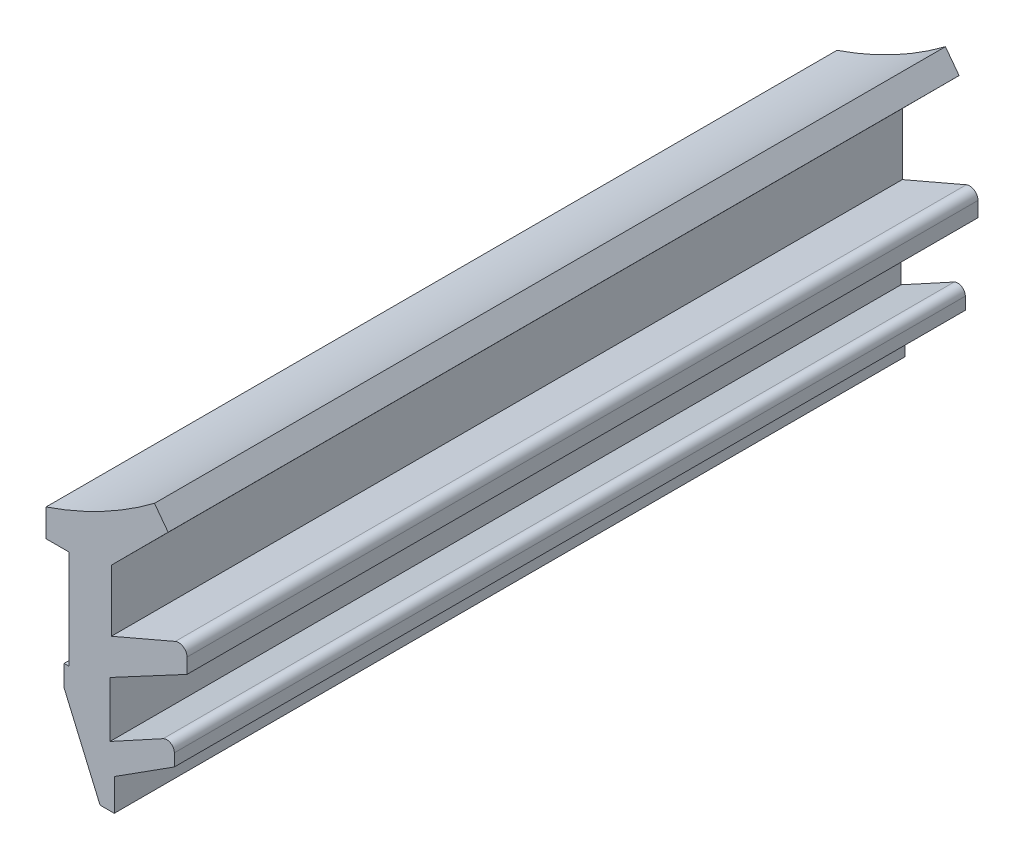
ISO-10303-21;
HEADER;
FILE_DESCRIPTION(('STEP AP214'),'2;1');
FILE_NAME('part.step','',(''),(''),'','','');
FILE_SCHEMA(('AUTOMOTIVE_DESIGN { 1 0 10303 214 1 1 1 1 }'));
ENDSEC;
DATA;
#1=APPLICATION_CONTEXT('core data for automotive mechanical design processes');
#2=APPLICATION_PROTOCOL_DEFINITION('international standard','automotive_design',2000,#1);
#3=PRODUCT_CONTEXT('',#1,'mechanical');
#4=PRODUCT('Part','Part','',(#3));
#5=PRODUCT_RELATED_PRODUCT_CATEGORY('part','',(#4));
#6=PRODUCT_DEFINITION_FORMATION('','',#4);
#7=PRODUCT_DEFINITION_CONTEXT('part definition',#1,'design');
#8=PRODUCT_DEFINITION('design','',#6,#7);
#9=PRODUCT_DEFINITION_SHAPE('','',#8);
#10=(LENGTH_UNIT() NAMED_UNIT(*) SI_UNIT(.MILLI.,.METRE.));
#11=(NAMED_UNIT(*) PLANE_ANGLE_UNIT() SI_UNIT($,.RADIAN.));
#12=(NAMED_UNIT(*) SI_UNIT($,.STERADIAN.) SOLID_ANGLE_UNIT());
#13=UNCERTAINTY_MEASURE_WITH_UNIT(LENGTH_MEASURE(1.E-05),#10,'distance_accuracy_value','');
#14=(GEOMETRIC_REPRESENTATION_CONTEXT(3) GLOBAL_UNCERTAINTY_ASSIGNED_CONTEXT((#13)) GLOBAL_UNIT_ASSIGNED_CONTEXT((#10,
#11,#12)) REPRESENTATION_CONTEXT('',''));
#15=CARTESIAN_POINT('',(0.,0.,0.));
#16=DIRECTION('',(0.,0.,1.));
#17=DIRECTION('',(1.,0.,0.));
#18=AXIS2_PLACEMENT_3D('',#15,#16,#17);
#19=CARTESIAN_POINT('',(0.,0.,40.));
#20=DIRECTION('',(0.,1.,0.));
#21=DIRECTION('',(0.,0.,1.));
#22=AXIS2_PLACEMENT_3D('',#19,#20,#21);
#23=PLANE('',#22);
#24=DIRECTION('',(1.,0.,0.));
#25=VECTOR('',#24,1.);
#26=CARTESIAN_POINT('',(0.,0.,0.));
#27=LINE('',#26,#25);
#28=CARTESIAN_POINT('',(-1.15231783764838,0.,0.));
#29=VERTEX_POINT('',#28);
#30=CARTESIAN_POINT('',(0.,0.,0.));
#31=VERTEX_POINT('',#30);
#32=EDGE_CURVE('E206',#29,#31,#27,.T.);
#33=ORIENTED_EDGE('',*,*,#32,.T.);
#34=DIRECTION('',(0.,0.,-1.));
#35=VECTOR('',#34,1.);
#36=CARTESIAN_POINT('',(0.,0.,40.));
#37=LINE('',#36,#35);
#38=CARTESIAN_POINT('',(0.,0.,40.));
#39=VERTEX_POINT('',#38);
#40=EDGE_CURVE('E11',#39,#31,#37,.T.);
#41=ORIENTED_EDGE('',*,*,#40,.F.);
#42=DIRECTION('',(1.,0.,0.));
#43=VECTOR('',#42,1.);
#44=CARTESIAN_POINT('',(0.,0.,40.));
#45=LINE('',#44,#43);
#46=CARTESIAN_POINT('',(-1.15231783764838,0.,40.));
#47=VERTEX_POINT('',#46);
#48=EDGE_CURVE('E246',#47,#39,#45,.T.);
#49=ORIENTED_EDGE('',*,*,#48,.F.);
#50=DIRECTION('',(0.,0.,-1.));
#51=VECTOR('',#50,1.);
#52=CARTESIAN_POINT('',(-1.15231783764838,0.,40.));
#53=LINE('',#52,#51);
#54=EDGE_CURVE('E202',#47,#29,#53,.T.);
#55=ORIENTED_EDGE('',*,*,#54,.T.);
#56=EDGE_LOOP('',(#33,#41,#49,#55));
#57=FACE_BOUND('',#56,.T.);
#58=ADVANCED_FACE('F32',(#57),#23,.F.);
#59=CARTESIAN_POINT('',(0.,0.,40.));
#60=DIRECTION('',(1.,0.,0.));
#61=DIRECTION('',(0.,1.,0.));
#62=AXIS2_PLACEMENT_3D('',#59,#60,#61);
#63=PLANE('',#62);
#64=DIRECTION('',(0.,-1.,0.));
#65=VECTOR('',#64,1.);
#66=CARTESIAN_POINT('',(0.,0.,0.));
#67=LINE('',#66,#65);
#68=CARTESIAN_POINT('',(0.,-5.,0.));
#69=VERTEX_POINT('',#68);
#70=EDGE_CURVE('E209',#31,#69,#67,.T.);
#71=ORIENTED_EDGE('',*,*,#70,.T.);
#72=DIRECTION('',(0.,0.,-1.));
#73=VECTOR('',#72,1.);
#74=CARTESIAN_POINT('',(0.,-5.,40.));
#75=LINE('',#74,#73);
#76=CARTESIAN_POINT('',(0.,-5.,40.));
#77=VERTEX_POINT('',#76);
#78=EDGE_CURVE('E40',#77,#69,#75,.T.);
#79=ORIENTED_EDGE('',*,*,#78,.F.);
#80=DIRECTION('',(0.,-1.,0.));
#81=VECTOR('',#80,1.);
#82=CARTESIAN_POINT('',(0.,0.,40.));
#83=LINE('',#82,#81);
#84=EDGE_CURVE('E130',#39,#77,#83,.T.);
#85=ORIENTED_EDGE('',*,*,#84,.F.);
#86=ORIENTED_EDGE('',*,*,#40,.T.);
#87=EDGE_LOOP('',(#71,#79,#85,#86));
#88=FACE_BOUND('',#87,.T.);
#89=ADVANCED_FACE('F369',(#88),#63,.F.);
#90=CARTESIAN_POINT('',(-0.235052358890928,-5.,40.));
#91=DIRECTION('',(0.,-1.,0.));
#92=DIRECTION('',(0.,0.,-1.));
#93=AXIS2_PLACEMENT_3D('',#90,#91,#92);
#94=PLANE('',#93);
#95=DIRECTION('',(-1.,0.,0.));
#96=VECTOR('',#95,1.);
#97=CARTESIAN_POINT('',(-0.235052358890928,-5.,0.));
#98=LINE('',#97,#96);
#99=CARTESIAN_POINT('',(-0.235052358890928,-5.,0.));
#100=VERTEX_POINT('',#99);
#101=EDGE_CURVE('E211',#69,#100,#98,.T.);
#102=ORIENTED_EDGE('',*,*,#101,.T.);
#103=DIRECTION('',(0.,0.,-1.));
#104=VECTOR('',#103,1.);
#105=CARTESIAN_POINT('',(-0.235052358890928,-5.,40.));
#106=LINE('',#105,#104);
#107=CARTESIAN_POINT('',(-0.235052358890928,-5.,40.));
#108=VERTEX_POINT('',#107);
#109=EDGE_CURVE('E292',#108,#100,#106,.T.);
#110=ORIENTED_EDGE('',*,*,#109,.F.);
#111=DIRECTION('',(-1.,0.,0.));
#112=VECTOR('',#111,1.);
#113=CARTESIAN_POINT('',(-0.235052358890928,-5.,40.));
#114=LINE('',#113,#112);
#115=EDGE_CURVE('E300',#77,#108,#114,.T.);
#116=ORIENTED_EDGE('',*,*,#115,.F.);
#117=ORIENTED_EDGE('',*,*,#78,.T.);
#118=EDGE_LOOP('',(#102,#110,#116,#117));
#119=FACE_BOUND('',#118,.T.);
#120=ADVANCED_FACE('F298',(#119),#94,.F.);
#121=CARTESIAN_POINT('',(-0.235052358890928,-6.07753064526559,40.));
#122=DIRECTION('',(1.,0.,0.));
#123=DIRECTION('',(0.,0.,-1.));
#124=AXIS2_PLACEMENT_3D('',#121,#122,#123);
#125=PLANE('',#124);
#126=DIRECTION('',(0.,-1.,0.));
#127=VECTOR('',#126,1.);
#128=CARTESIAN_POINT('',(-0.235052358890928,-6.07753064526559,0.));
#129=LINE('',#128,#127);
#130=CARTESIAN_POINT('',(-0.235052358890928,-6.07753064526559,0.));
#131=VERTEX_POINT('',#130);
#132=EDGE_CURVE('E213',#100,#131,#129,.T.);
#133=ORIENTED_EDGE('',*,*,#132,.T.);
#134=DIRECTION('',(0.,0.,-1.));
#135=VECTOR('',#134,1.);
#136=CARTESIAN_POINT('',(-0.235052358890928,-6.07753064526559,40.));
#137=LINE('',#136,#135);
#138=CARTESIAN_POINT('',(-0.235052358890928,-6.07753064526559,40.));
#139=VERTEX_POINT('',#138);
#140=EDGE_CURVE('E289',#139,#131,#137,.T.);
#141=ORIENTED_EDGE('',*,*,#140,.F.);
#142=DIRECTION('',(0.,-1.,0.));
#143=VECTOR('',#142,1.);
#144=CARTESIAN_POINT('',(-0.235052358890928,-6.07753064526559,40.));
#145=LINE('',#144,#143);
#146=EDGE_CURVE('E318',#108,#139,#145,.T.);
#147=ORIENTED_EDGE('',*,*,#146,.F.);
#148=ORIENTED_EDGE('',*,*,#109,.T.);
#149=EDGE_LOOP('',(#133,#141,#147,#148));
#150=FACE_BOUND('',#149,.T.);
#151=ADVANCED_FACE('F309',(#150),#125,.F.);
#152=CARTESIAN_POINT('',(1.5808794778396,-10.3000267175351,40.));
#153=DIRECTION('',(0.918648775054495,0.395075218269732,0.));
#154=DIRECTION('',(-0.395075218269732,0.918648775054495,0.));
#155=AXIS2_PLACEMENT_3D('',#152,#153,#154);
#156=PLANE('',#155);
#157=DIRECTION('',(0.395075218269732,-0.918648775054495,0.));
#158=VECTOR('',#157,1.);
#159=CARTESIAN_POINT('',(1.5808794778396,-10.3000267175351,0.));
#160=LINE('',#159,#158);
#161=CARTESIAN_POINT('',(1.5808794778396,-10.3000267175351,0.));
#162=VERTEX_POINT('',#161);
#163=EDGE_CURVE('E215',#131,#162,#160,.T.);
#164=ORIENTED_EDGE('',*,*,#163,.T.);
#165=DIRECTION('',(0.,0.,-1.));
#166=VECTOR('',#165,1.);
#167=CARTESIAN_POINT('',(1.5808794778396,-10.3000267175351,40.));
#168=LINE('',#167,#166);
#169=CARTESIAN_POINT('',(1.5808794778396,-10.3000267175351,40.));
#170=VERTEX_POINT('',#169);
#171=EDGE_CURVE('E286',#170,#162,#168,.T.);
#172=ORIENTED_EDGE('',*,*,#171,.F.);
#173=DIRECTION('',(0.395075218269732,-0.918648775054495,0.));
#174=VECTOR('',#173,1.);
#175=CARTESIAN_POINT('',(1.5808794778396,-10.3000267175351,40.));
#176=LINE('',#175,#174);
#177=EDGE_CURVE('E315',#139,#170,#176,.T.);
#178=ORIENTED_EDGE('',*,*,#177,.F.);
#179=ORIENTED_EDGE('',*,*,#140,.T.);
#180=EDGE_LOOP('',(#164,#172,#178,#179));
#181=FACE_BOUND('',#180,.T.);
#182=ADVANCED_FACE('F313',(#181),#156,.F.);
#183=CARTESIAN_POINT('',(2.29987679427467,-10.3000267175351,40.));
#184=DIRECTION('',(0.,1.,0.));
#185=DIRECTION('',(0.,0.,1.));
#186=AXIS2_PLACEMENT_3D('',#183,#184,#185);
#187=PLANE('',#186);
#188=DIRECTION('',(1.,0.,0.));
#189=VECTOR('',#188,1.);
#190=CARTESIAN_POINT('',(2.29987679427467,-10.3000267175351,0.));
#191=LINE('',#190,#189);
#192=CARTESIAN_POINT('',(2.29987679427467,-10.3000267175351,0.));
#193=VERTEX_POINT('',#192);
#194=EDGE_CURVE('E217',#162,#193,#191,.T.);
#195=ORIENTED_EDGE('',*,*,#194,.T.);
#196=DIRECTION('',(0.,0.,-1.));
#197=VECTOR('',#196,1.);
#198=CARTESIAN_POINT('',(2.29987679427467,-10.3000267175351,40.));
#199=LINE('',#198,#197);
#200=CARTESIAN_POINT('',(2.29987679427467,-10.3000267175351,40.));
#201=VERTEX_POINT('',#200);
#202=EDGE_CURVE('E283',#201,#193,#199,.T.);
#203=ORIENTED_EDGE('',*,*,#202,.F.);
#204=DIRECTION('',(1.,0.,0.));
#205=VECTOR('',#204,1.);
#206=CARTESIAN_POINT('',(2.29987679427467,-10.3000267175351,40.));
#207=LINE('',#206,#205);
#208=EDGE_CURVE('E317',#170,#201,#207,.T.);
#209=ORIENTED_EDGE('',*,*,#208,.F.);
#210=ORIENTED_EDGE('',*,*,#171,.T.);
#211=EDGE_LOOP('',(#195,#203,#209,#210));
#212=FACE_BOUND('',#211,.T.);
#213=ADVANCED_FACE('F382',(#212),#187,.F.);
#214=CARTESIAN_POINT('',(2.29987679427468,-8.68824894517343,40.));
#215=DIRECTION('',(-1.,0.,0.));
#216=DIRECTION('',(0.,-1.,0.));
#217=AXIS2_PLACEMENT_3D('',#214,#215,#216);
#218=PLANE('',#217);
#219=DIRECTION('',(0.,1.,0.));
#220=VECTOR('',#219,1.);
#221=CARTESIAN_POINT('',(2.29987679427468,-8.68824894517343,0.));
#222=LINE('',#221,#220);
#223=CARTESIAN_POINT('',(2.29987679427468,-8.68824894517343,0.));
#224=VERTEX_POINT('',#223);
#225=EDGE_CURVE('E219',#193,#224,#222,.T.);
#226=ORIENTED_EDGE('',*,*,#225,.T.);
#227=DIRECTION('',(0.,0.,-1.));
#228=VECTOR('',#227,1.);
#229=CARTESIAN_POINT('',(2.29987679427468,-8.68824894517343,40.));
#230=LINE('',#229,#228);
#231=CARTESIAN_POINT('',(2.29987679427468,-8.68824894517343,40.));
#232=VERTEX_POINT('',#231);
#233=EDGE_CURVE('E280',#232,#224,#230,.T.);
#234=ORIENTED_EDGE('',*,*,#233,.F.);
#235=DIRECTION('',(0.,1.,0.));
#236=VECTOR('',#235,1.);
#237=CARTESIAN_POINT('',(2.29987679427468,-8.68824894517343,40.));
#238=LINE('',#237,#236);
#239=EDGE_CURVE('E320',#201,#232,#238,.T.);
#240=ORIENTED_EDGE('',*,*,#239,.F.);
#241=ORIENTED_EDGE('',*,*,#202,.T.);
#242=EDGE_LOOP('',(#226,#234,#240,#241));
#243=FACE_BOUND('',#242,.T.);
#244=ADVANCED_FACE('F385',(#243),#218,.F.);
#245=CARTESIAN_POINT('',(5.33873382518314,-6.74938038249143,40.));
#246=DIRECTION('',(-0.537872352236164,0.843026294192498,0.));
#247=DIRECTION('',(-0.843026294192498,-0.537872352236164,0.));
#248=AXIS2_PLACEMENT_3D('',#245,#246,#247);
#249=PLANE('',#248);
#250=DIRECTION('',(0.843026294192498,0.537872352236164,0.));
#251=VECTOR('',#250,1.);
#252=CARTESIAN_POINT('',(5.33873382518314,-6.74938038249143,0.));
#253=LINE('',#252,#251);
#254=CARTESIAN_POINT('',(5.33873382518314,-6.74938038249143,0.));
#255=VERTEX_POINT('',#254);
#256=EDGE_CURVE('E221',#224,#255,#253,.T.);
#257=ORIENTED_EDGE('',*,*,#256,.T.);
#258=DIRECTION('',(0.,0.,-1.));
#259=VECTOR('',#258,1.);
#260=CARTESIAN_POINT('',(5.33873382518314,-6.74938038249143,40.));
#261=LINE('',#260,#259);
#262=CARTESIAN_POINT('',(5.33873382518314,-6.74938038249143,40.));
#263=VERTEX_POINT('',#262);
#264=EDGE_CURVE('E277',#263,#255,#261,.T.);
#265=ORIENTED_EDGE('',*,*,#264,.F.);
#266=DIRECTION('',(0.843026294192498,0.537872352236164,0.));
#267=VECTOR('',#266,1.);
#268=CARTESIAN_POINT('',(5.33873382518314,-6.74938038249143,40.));
#269=LINE('',#268,#267);
#270=EDGE_CURVE('E326',#232,#263,#269,.T.);
#271=ORIENTED_EDGE('',*,*,#270,.F.);
#272=ORIENTED_EDGE('',*,*,#233,.T.);
#273=EDGE_LOOP('',(#257,#265,#271,#272));
#274=FACE_BOUND('',#273,.T.);
#275=ADVANCED_FACE('F389',(#274),#249,.F.);
#276=CARTESIAN_POINT('',(5.33873382518314,-6.13011881651297,40.));
#277=DIRECTION('',(-1.,0.,0.));
#278=DIRECTION('',(0.,0.,1.));
#279=AXIS2_PLACEMENT_3D('',#276,#277,#278);
#280=PLANE('',#279);
#281=DIRECTION('',(0.,1.,0.));
#282=VECTOR('',#281,1.);
#283=CARTESIAN_POINT('',(5.33873382518314,-6.13011881651297,0.));
#284=LINE('',#283,#282);
#285=CARTESIAN_POINT('',(5.33873382518314,-6.13011881651297,0.));
#286=VERTEX_POINT('',#285);
#287=EDGE_CURVE('E223',#255,#286,#284,.T.);
#288=ORIENTED_EDGE('',*,*,#287,.T.);
#289=DIRECTION('',(0.,0.,-1.));
#290=VECTOR('',#289,1.);
#291=CARTESIAN_POINT('',(5.33873382518314,-6.13011881651297,40.));
#292=LINE('',#291,#290);
#293=CARTESIAN_POINT('',(5.33873382518314,-6.13011881651297,40.));
#294=VERTEX_POINT('',#293);
#295=EDGE_CURVE('E274',#294,#286,#292,.T.);
#296=ORIENTED_EDGE('',*,*,#295,.F.);
#297=DIRECTION('',(0.,1.,0.));
#298=VECTOR('',#297,1.);
#299=CARTESIAN_POINT('',(5.33873382518314,-6.13011881651297,40.));
#300=LINE('',#299,#298);
#301=EDGE_CURVE('E328',#263,#294,#300,.T.);
#302=ORIENTED_EDGE('',*,*,#301,.F.);
#303=ORIENTED_EDGE('',*,*,#264,.T.);
#304=EDGE_LOOP('',(#288,#296,#302,#303));
#305=FACE_BOUND('',#304,.T.);
#306=ADVANCED_FACE('F393',(#305),#280,.F.);
#307=CARTESIAN_POINT('',(4.95553251470766,-6.13011881651297,40.));
#308=DIRECTION('',(0.,0.,-1.));
#309=DIRECTION('',(-1.,0.,0.));
#310=AXIS2_PLACEMENT_3D('',#307,#308,#309);
#311=CYLINDRICAL_SURFACE('',#310,0.383201310475476);
#312=CARTESIAN_POINT('',(4.95553251470766,-6.13011881651297,0.));
#313=DIRECTION('',(0.,0.,1.));
#314=DIRECTION('',(-1.,0.,0.));
#315=AXIS2_PLACEMENT_3D('',#312,#313,#314);
#316=CIRCLE('',#315,0.383201310475476);
#317=CARTESIAN_POINT('',(4.77208537812459,-5.79368101776022,0.));
#318=VERTEX_POINT('',#317);
#319=EDGE_CURVE('E225',#286,#318,#316,.T.);
#320=ORIENTED_EDGE('',*,*,#319,.T.);
#321=DIRECTION('',(0.,0.,-1.));
#322=VECTOR('',#321,1.);
#323=CARTESIAN_POINT('',(4.77208537812459,-5.79368101776022,40.));
#324=LINE('',#323,#322);
#325=CARTESIAN_POINT('',(4.77208537812459,-5.79368101776022,40.));
#326=VERTEX_POINT('',#325);
#327=EDGE_CURVE('E271',#326,#318,#324,.T.);
#328=ORIENTED_EDGE('',*,*,#327,.F.);
#329=CARTESIAN_POINT('',(4.95553251470766,-6.13011881651297,40.));
#330=DIRECTION('',(0.,0.,1.));
#331=DIRECTION('',(-1.,0.,0.));
#332=AXIS2_PLACEMENT_3D('',#329,#330,#331);
#333=CIRCLE('',#332,0.383201310475476);
#334=EDGE_CURVE('E330',#294,#326,#333,.T.);
#335=ORIENTED_EDGE('',*,*,#334,.F.);
#336=ORIENTED_EDGE('',*,*,#295,.T.);
#337=EDGE_LOOP('',(#320,#328,#335,#336));
#338=FACE_BOUND('',#337,.T.);
#339=ADVANCED_FACE('F397',(#338),#311,.T.);
#340=CARTESIAN_POINT('',(2.08550430849602,-7.25857469572612,40.));
#341=DIRECTION('',(0.478722623248482,-0.877966200938335,0.));
#342=DIRECTION('',(0.877966200938335,0.478722623248482,0.));
#343=AXIS2_PLACEMENT_3D('',#340,#341,#342);
#344=PLANE('',#343);
#345=DIRECTION('',(-0.877966200938335,-0.478722623248482,0.));
#346=VECTOR('',#345,1.);
#347=CARTESIAN_POINT('',(2.08550430849602,-7.25857469572612,0.));
#348=LINE('',#347,#346);
#349=CARTESIAN_POINT('',(2.08550430849602,-7.25857469572612,0.));
#350=VERTEX_POINT('',#349);
#351=EDGE_CURVE('E227',#318,#350,#348,.T.);
#352=ORIENTED_EDGE('',*,*,#351,.T.);
#353=DIRECTION('',(0.,0.,-1.));
#354=VECTOR('',#353,1.);
#355=CARTESIAN_POINT('',(2.08550430849602,-7.25857469572612,40.));
#356=LINE('',#355,#354);
#357=CARTESIAN_POINT('',(2.08550430849602,-7.25857469572612,40.));
#358=VERTEX_POINT('',#357);
#359=EDGE_CURVE('E268',#358,#350,#356,.T.);
#360=ORIENTED_EDGE('',*,*,#359,.F.);
#361=DIRECTION('',(-0.877966200938335,-0.478722623248482,0.));
#362=VECTOR('',#361,1.);
#363=CARTESIAN_POINT('',(2.08550430849602,-7.25857469572612,40.));
#364=LINE('',#363,#362);
#365=EDGE_CURVE('E332',#326,#358,#364,.T.);
#366=ORIENTED_EDGE('',*,*,#365,.F.);
#367=ORIENTED_EDGE('',*,*,#327,.T.);
#368=EDGE_LOOP('',(#352,#360,#366,#367));
#369=FACE_BOUND('',#368,.T.);
#370=ADVANCED_FACE('F401',(#369),#344,.F.);
#371=CARTESIAN_POINT('',(2.08550430849602,-4.45645656018393,40.));
#372=DIRECTION('',(-1.,0.,0.));
#373=DIRECTION('',(0.,-1.,0.));
#374=AXIS2_PLACEMENT_3D('',#371,#372,#373);
#375=PLANE('',#374);
#376=DIRECTION('',(0.,1.,0.));
#377=VECTOR('',#376,1.);
#378=CARTESIAN_POINT('',(2.08550430849602,-4.45645656018393,0.));
#379=LINE('',#378,#377);
#380=CARTESIAN_POINT('',(2.08550430849602,-4.45645656018393,0.));
#381=VERTEX_POINT('',#380);
#382=EDGE_CURVE('E229',#350,#381,#379,.T.);
#383=ORIENTED_EDGE('',*,*,#382,.T.);
#384=DIRECTION('',(0.,0.,-1.));
#385=VECTOR('',#384,1.);
#386=CARTESIAN_POINT('',(2.08550430849602,-4.45645656018393,40.));
#387=LINE('',#386,#385);
#388=CARTESIAN_POINT('',(2.08550430849602,-4.45645656018393,40.));
#389=VERTEX_POINT('',#388);
#390=EDGE_CURVE('E265',#389,#381,#387,.T.);
#391=ORIENTED_EDGE('',*,*,#390,.F.);
#392=DIRECTION('',(0.,1.,0.));
#393=VECTOR('',#392,1.);
#394=CARTESIAN_POINT('',(2.08550430849602,-4.45645656018393,40.));
#395=LINE('',#394,#393);
#396=EDGE_CURVE('E334',#358,#389,#395,.T.);
#397=ORIENTED_EDGE('',*,*,#396,.F.);
#398=ORIENTED_EDGE('',*,*,#359,.T.);
#399=EDGE_LOOP('',(#383,#391,#397,#398));
#400=FACE_BOUND('',#399,.T.);
#401=ADVANCED_FACE('F405',(#400),#375,.F.);
#402=CARTESIAN_POINT('',(5.98011000399035,-2.37422166333738,40.));
#403=DIRECTION('',(-0.471489157423312,0.881871858283422,0.));
#404=DIRECTION('',(-0.881871858283422,-0.471489157423312,0.));
#405=AXIS2_PLACEMENT_3D('',#402,#403,#404);
#406=PLANE('',#405);
#407=DIRECTION('',(0.881871858283421,0.471489157423312,0.));
#408=VECTOR('',#407,1.);
#409=CARTESIAN_POINT('',(5.98011000399035,-2.37422166333738,0.));
#410=LINE('',#409,#408);
#411=CARTESIAN_POINT('',(5.98011000399035,-2.37422166333738,0.));
#412=VERTEX_POINT('',#411);
#413=EDGE_CURVE('E231',#381,#412,#410,.T.);
#414=ORIENTED_EDGE('',*,*,#413,.T.);
#415=DIRECTION('',(0.,0.,-1.));
#416=VECTOR('',#415,1.);
#417=CARTESIAN_POINT('',(5.98011000399035,-2.37422166333738,40.));
#418=LINE('',#417,#416);
#419=CARTESIAN_POINT('',(5.98011000399035,-2.37422166333738,40.));
#420=VERTEX_POINT('',#419);
#421=EDGE_CURVE('E262',#420,#412,#418,.T.);
#422=ORIENTED_EDGE('',*,*,#421,.F.);
#423=DIRECTION('',(0.881871858283421,0.471489157423312,0.));
#424=VECTOR('',#423,1.);
#425=CARTESIAN_POINT('',(5.98011000399035,-2.37422166333738,40.));
#426=LINE('',#425,#424);
#427=EDGE_CURVE('E336',#389,#420,#426,.T.);
#428=ORIENTED_EDGE('',*,*,#427,.F.);
#429=ORIENTED_EDGE('',*,*,#390,.T.);
#430=EDGE_LOOP('',(#414,#422,#428,#429));
#431=FACE_BOUND('',#430,.T.);
#432=ADVANCED_FACE('F409',(#431),#406,.F.);
#433=CARTESIAN_POINT('',(5.98011000399035,-1.61723627898411,40.));
#434=DIRECTION('',(-1.,0.,0.));
#435=DIRECTION('',(0.,0.,1.));
#436=AXIS2_PLACEMENT_3D('',#433,#434,#435);
#437=PLANE('',#436);
#438=DIRECTION('',(0.,1.,0.));
#439=VECTOR('',#438,1.);
#440=CARTESIAN_POINT('',(5.98011000399035,-1.61723627898411,0.));
#441=LINE('',#440,#439);
#442=CARTESIAN_POINT('',(5.98011000399035,-1.61723627898411,0.));
#443=VERTEX_POINT('',#442);
#444=EDGE_CURVE('E233',#412,#443,#441,.T.);
#445=ORIENTED_EDGE('',*,*,#444,.T.);
#446=DIRECTION('',(0.,0.,-1.));
#447=VECTOR('',#446,1.);
#448=CARTESIAN_POINT('',(5.98011000399035,-1.61723627898411,40.));
#449=LINE('',#448,#447);
#450=CARTESIAN_POINT('',(5.98011000399035,-1.61723627898411,40.));
#451=VERTEX_POINT('',#450);
#452=EDGE_CURVE('E259',#451,#443,#449,.T.);
#453=ORIENTED_EDGE('',*,*,#452,.F.);
#454=DIRECTION('',(0.,1.,0.));
#455=VECTOR('',#454,1.);
#456=CARTESIAN_POINT('',(5.98011000399035,-1.61723627898411,40.));
#457=LINE('',#456,#455);
#458=EDGE_CURVE('E338',#420,#451,#457,.T.);
#459=ORIENTED_EDGE('',*,*,#458,.F.);
#460=ORIENTED_EDGE('',*,*,#421,.T.);
#461=EDGE_LOOP('',(#445,#453,#459,#460));
#462=FACE_BOUND('',#461,.T.);
#463=ADVANCED_FACE('F413',(#462),#437,.F.);
#464=CARTESIAN_POINT('',(5.55493297747918,-1.61723627898411,40.));
#465=DIRECTION('',(0.,0.,-1.));
#466=DIRECTION('',(-1.,0.,0.));
#467=AXIS2_PLACEMENT_3D('',#464,#465,#466);
#468=CYLINDRICAL_SURFACE('',#467,0.425177026511167);
#469=CARTESIAN_POINT('',(5.55493297747918,-1.61723627898411,0.));
#470=DIRECTION('',(0.,0.,1.));
#471=DIRECTION('',(-1.,0.,0.));
#472=AXIS2_PLACEMENT_3D('',#469,#470,#471);
#473=CIRCLE('',#472,0.425177026511167);
#474=CARTESIAN_POINT('',(5.38695607092701,-1.22664792439832,0.));
#475=VERTEX_POINT('',#474);
#476=EDGE_CURVE('E235',#443,#475,#473,.T.);
#477=ORIENTED_EDGE('',*,*,#476,.T.);
#478=DIRECTION('',(0.,0.,-1.));
#479=VECTOR('',#478,1.);
#480=CARTESIAN_POINT('',(5.38695607092701,-1.22664792439832,40.));
#481=LINE('',#480,#479);
#482=CARTESIAN_POINT('',(5.38695607092701,-1.22664792439832,40.));
#483=VERTEX_POINT('',#482);
#484=EDGE_CURVE('E256',#483,#475,#481,.T.);
#485=ORIENTED_EDGE('',*,*,#484,.F.);
#486=CARTESIAN_POINT('',(5.55493297747918,-1.61723627898411,40.));
#487=DIRECTION('',(0.,0.,1.));
#488=DIRECTION('',(-1.,0.,0.));
#489=AXIS2_PLACEMENT_3D('',#486,#487,#488);
#490=CIRCLE('',#489,0.425177026511167);
#491=EDGE_CURVE('E340',#451,#483,#490,.T.);
#492=ORIENTED_EDGE('',*,*,#491,.F.);
#493=ORIENTED_EDGE('',*,*,#452,.T.);
#494=EDGE_LOOP('',(#477,#485,#492,#493));
#495=FACE_BOUND('',#494,.T.);
#496=ADVANCED_FACE('F417',(#495),#468,.T.);
#497=CARTESIAN_POINT('',(2.15420838020219,-2.61692735893881,40.));
#498=DIRECTION('',(0.395075218269732,-0.918648775054495,0.));
#499=DIRECTION('',(0.918648775054495,0.395075218269732,0.));
#500=AXIS2_PLACEMENT_3D('',#497,#498,#499);
#501=PLANE('',#500);
#502=DIRECTION('',(-0.918648775054495,-0.395075218269732,0.));
#503=VECTOR('',#502,1.);
#504=CARTESIAN_POINT('',(2.15420838020219,-2.61692735893881,0.));
#505=LINE('',#504,#503);
#506=CARTESIAN_POINT('',(2.15420838020219,-2.61692735893881,0.));
#507=VERTEX_POINT('',#506);
#508=EDGE_CURVE('E237',#475,#507,#505,.T.);
#509=ORIENTED_EDGE('',*,*,#508,.T.);
#510=DIRECTION('',(0.,0.,-1.));
#511=VECTOR('',#510,1.);
#512=CARTESIAN_POINT('',(2.15420838020219,-2.61692735893881,40.));
#513=LINE('',#512,#511);
#514=CARTESIAN_POINT('',(2.15420838020219,-2.61692735893881,40.));
#515=VERTEX_POINT('',#514);
#516=EDGE_CURVE('E253',#515,#507,#513,.T.);
#517=ORIENTED_EDGE('',*,*,#516,.F.);
#518=DIRECTION('',(-0.918648775054495,-0.395075218269732,0.));
#519=VECTOR('',#518,1.);
#520=CARTESIAN_POINT('',(2.15420838020219,-2.61692735893881,40.));
#521=LINE('',#520,#519);
#522=EDGE_CURVE('E342',#483,#515,#521,.T.);
#523=ORIENTED_EDGE('',*,*,#522,.F.);
#524=ORIENTED_EDGE('',*,*,#484,.T.);
#525=EDGE_LOOP('',(#509,#517,#523,#524));
#526=FACE_BOUND('',#525,.T.);
#527=ADVANCED_FACE('F421',(#526),#501,.F.);
#528=CARTESIAN_POINT('',(2.15420838020219,0.497930702141715,40.));
#529=DIRECTION('',(-1.,0.,0.));
#530=DIRECTION('',(0.,0.,1.));
#531=AXIS2_PLACEMENT_3D('',#528,#529,#530);
#532=PLANE('',#531);
#533=DIRECTION('',(0.,1.,0.));
#534=VECTOR('',#533,1.);
#535=CARTESIAN_POINT('',(2.15420838020219,0.497930702141715,0.));
#536=LINE('',#535,#534);
#537=CARTESIAN_POINT('',(2.15420838020219,0.497930702141715,0.));
#538=VERTEX_POINT('',#537);
#539=EDGE_CURVE('E239',#507,#538,#536,.T.);
#540=ORIENTED_EDGE('',*,*,#539,.T.);
#541=DIRECTION('',(0.,0.,-1.));
#542=VECTOR('',#541,1.);
#543=CARTESIAN_POINT('',(2.15420838020219,0.497930702141715,40.));
#544=LINE('',#543,#542);
#545=CARTESIAN_POINT('',(2.15420838020219,0.497930702141715,40.));
#546=VERTEX_POINT('',#545);
#547=EDGE_CURVE('E250',#546,#538,#544,.T.);
#548=ORIENTED_EDGE('',*,*,#547,.F.);
#549=DIRECTION('',(0.,1.,0.));
#550=VECTOR('',#549,1.);
#551=CARTESIAN_POINT('',(2.15420838020219,0.497930702141715,40.));
#552=LINE('',#551,#550);
#553=EDGE_CURVE('E344',#515,#546,#552,.T.);
#554=ORIENTED_EDGE('',*,*,#553,.F.);
#555=ORIENTED_EDGE('',*,*,#516,.T.);
#556=EDGE_LOOP('',(#540,#548,#554,#555));
#557=FACE_BOUND('',#556,.T.);
#558=ADVANCED_FACE('F350',(#557),#532,.F.);
#559=CARTESIAN_POINT('',(5.02483194822369,3.37361970784197,40.));
#560=DIRECTION('',(-0.70772982860962,0.706483184298252,0.));
#561=DIRECTION('',(-0.706483184298252,-0.70772982860962,0.));
#562=AXIS2_PLACEMENT_3D('',#559,#560,#561);
#563=PLANE('',#562);
#564=DIRECTION('',(0.706483184298252,0.70772982860962,0.));
#565=VECTOR('',#564,1.);
#566=CARTESIAN_POINT('',(5.02483194822369,3.37361970784197,0.));
#567=LINE('',#566,#565);
#568=CARTESIAN_POINT('',(5.02483194822369,3.37361970784197,0.));
#569=VERTEX_POINT('',#568);
#570=EDGE_CURVE('E241',#538,#569,#567,.T.);
#571=ORIENTED_EDGE('',*,*,#570,.T.);
#572=DIRECTION('',(0.,0.,-1.));
#573=VECTOR('',#572,1.);
#574=CARTESIAN_POINT('',(5.02483194822369,3.37361970784197,40.));
#575=LINE('',#574,#573);
#576=CARTESIAN_POINT('',(5.02483194822369,3.37361970784197,40.));
#577=VERTEX_POINT('',#576);
#578=EDGE_CURVE('E197',#577,#569,#575,.T.);
#579=ORIENTED_EDGE('',*,*,#578,.F.);
#580=DIRECTION('',(0.706483184298252,0.70772982860962,0.));
#581=VECTOR('',#580,1.);
#582=CARTESIAN_POINT('',(5.02483194822369,3.37361970784197,40.));
#583=LINE('',#582,#581);
#584=EDGE_CURVE('E188',#546,#577,#583,.T.);
#585=ORIENTED_EDGE('',*,*,#584,.F.);
#586=ORIENTED_EDGE('',*,*,#547,.T.);
#587=EDGE_LOOP('',(#571,#579,#585,#586));
#588=FACE_BOUND('',#587,.T.);
#589=ADVANCED_FACE('F354',(#588),#563,.F.);
#590=CARTESIAN_POINT('',(4.33360146648141,4.29441648142376,40.));
#591=DIRECTION('',(-0.799736070703984,-0.600351744575588,0.));
#592=DIRECTION('',(0.600351744575588,-0.799736070703984,0.));
#593=AXIS2_PLACEMENT_3D('',#590,#591,#592);
#594=PLANE('',#593);
#595=DIRECTION('',(-0.600351744575588,0.799736070703984,0.));
#596=VECTOR('',#595,1.);
#597=CARTESIAN_POINT('',(4.33360146648141,4.29441648142376,0.));
#598=LINE('',#597,#596);
#599=CARTESIAN_POINT('',(4.33360146648141,4.29441648142376,0.));
#600=VERTEX_POINT('',#599);
#601=EDGE_CURVE('E196',#569,#600,#598,.T.);
#602=ORIENTED_EDGE('',*,*,#601,.T.);
#603=DIRECTION('',(0.,0.,-1.));
#604=VECTOR('',#603,1.);
#605=CARTESIAN_POINT('',(4.33360146648141,4.29441648142376,40.));
#606=LINE('',#605,#604);
#607=CARTESIAN_POINT('',(4.33360146648141,4.29441648142376,40.));
#608=VERTEX_POINT('',#607);
#609=EDGE_CURVE('E193',#608,#600,#606,.T.);
#610=ORIENTED_EDGE('',*,*,#609,.F.);
#611=DIRECTION('',(-0.600351744575588,0.799736070703984,0.));
#612=VECTOR('',#611,1.);
#613=CARTESIAN_POINT('',(4.33360146648141,4.29441648142376,40.));
#614=LINE('',#613,#612);
#615=EDGE_CURVE('E182',#577,#608,#614,.T.);
#616=ORIENTED_EDGE('',*,*,#615,.F.);
#617=ORIENTED_EDGE('',*,*,#578,.T.);
#618=EDGE_LOOP('',(#602,#610,#616,#617));
#619=FACE_BOUND('',#618,.T.);
#620=ADVANCED_FACE('F194',(#619),#594,.F.);
#621=CARTESIAN_POINT('',(-7.56114950539438,20.1395630812312,40.));
#622=DIRECTION('',(0.,0.,-1.));
#623=DIRECTION('',(-1.,0.,0.));
#624=AXIS2_PLACEMENT_3D('',#621,#622,#623);
#625=CYLINDRICAL_SURFACE('',#624,19.8129697787164);
#626=CARTESIAN_POINT('',(-7.56114950539438,20.1395630812312,0.));
#627=DIRECTION('',(0.,0.,-1.));
#628=DIRECTION('',(1.,0.,0.));
#629=AXIS2_PLACEMENT_3D('',#626,#627,#628);
#630=CIRCLE('',#629,19.8129697787164);
#631=CARTESIAN_POINT('',(-1.15231783764838,1.39174592544409,0.));
#632=VERTEX_POINT('',#631);
#633=EDGE_CURVE('E116',#600,#632,#630,.T.);
#634=ORIENTED_EDGE('',*,*,#633,.T.);
#635=DIRECTION('',(0.,0.,-1.));
#636=VECTOR('',#635,1.);
#637=CARTESIAN_POINT('',(-1.15231783764838,1.39174592544409,40.));
#638=LINE('',#637,#636);
#639=CARTESIAN_POINT('',(-1.15231783764838,1.39174592544409,40.));
#640=VERTEX_POINT('',#639);
#641=EDGE_CURVE('E198',#640,#632,#638,.T.);
#642=ORIENTED_EDGE('',*,*,#641,.F.);
#643=CARTESIAN_POINT('',(-7.56114950539438,20.1395630812312,40.));
#644=DIRECTION('',(0.,0.,-1.));
#645=DIRECTION('',(1.,0.,0.));
#646=AXIS2_PLACEMENT_3D('',#643,#644,#645);
#647=CIRCLE('',#646,19.8129697787164);
#648=EDGE_CURVE('E186',#608,#640,#647,.T.);
#649=ORIENTED_EDGE('',*,*,#648,.F.);
#650=ORIENTED_EDGE('',*,*,#609,.T.);
#651=EDGE_LOOP('',(#634,#642,#649,#650));
#652=FACE_BOUND('',#651,.T.);
#653=ADVANCED_FACE('F200',(#652),#625,.F.);
#654=CARTESIAN_POINT('',(-1.15231783764838,0.,40.));
#655=DIRECTION('',(1.,0.,0.));
#656=DIRECTION('',(0.,0.,-1.));
#657=AXIS2_PLACEMENT_3D('',#654,#655,#656);
#658=PLANE('',#657);
#659=DIRECTION('',(0.,-1.,0.));
#660=VECTOR('',#659,1.);
#661=CARTESIAN_POINT('',(-1.15231783764838,0.,0.));
#662=LINE('',#661,#660);
#663=EDGE_CURVE('E122',#632,#29,#662,.T.);
#664=ORIENTED_EDGE('',*,*,#663,.T.);
#665=ORIENTED_EDGE('',*,*,#54,.F.);
#666=DIRECTION('',(0.,-1.,0.));
#667=VECTOR('',#666,1.);
#668=CARTESIAN_POINT('',(-1.15231783764838,0.,40.));
#669=LINE('',#668,#667);
#670=EDGE_CURVE('E48',#640,#47,#669,.T.);
#671=ORIENTED_EDGE('',*,*,#670,.F.);
#672=ORIENTED_EDGE('',*,*,#641,.T.);
#673=EDGE_LOOP('',(#664,#665,#671,#672));
#674=FACE_BOUND('',#673,.T.);
#675=ADVANCED_FACE('F358',(#674),#658,.F.);
#676=CARTESIAN_POINT('',(-7.56114950539438,20.1395630812312,40.));
#677=DIRECTION('',(0.,0.,1.));
#678=DIRECTION('',(1.,0.,0.));
#679=AXIS2_PLACEMENT_3D('',#676,#677,#678);
#680=PLANE('',#679);
#681=ORIENTED_EDGE('',*,*,#48,.T.);
#682=ORIENTED_EDGE('',*,*,#84,.T.);
#683=ORIENTED_EDGE('',*,*,#115,.T.);
#684=ORIENTED_EDGE('',*,*,#146,.T.);
#685=ORIENTED_EDGE('',*,*,#177,.T.);
#686=ORIENTED_EDGE('',*,*,#208,.T.);
#687=ORIENTED_EDGE('',*,*,#239,.T.);
#688=ORIENTED_EDGE('',*,*,#270,.T.);
#689=ORIENTED_EDGE('',*,*,#301,.T.);
#690=ORIENTED_EDGE('',*,*,#334,.T.);
#691=ORIENTED_EDGE('',*,*,#365,.T.);
#692=ORIENTED_EDGE('',*,*,#396,.T.);
#693=ORIENTED_EDGE('',*,*,#427,.T.);
#694=ORIENTED_EDGE('',*,*,#458,.T.);
#695=ORIENTED_EDGE('',*,*,#491,.T.);
#696=ORIENTED_EDGE('',*,*,#522,.T.);
#697=ORIENTED_EDGE('',*,*,#553,.T.);
#698=ORIENTED_EDGE('',*,*,#584,.T.);
#699=ORIENTED_EDGE('',*,*,#615,.T.);
#700=ORIENTED_EDGE('',*,*,#648,.T.);
#701=ORIENTED_EDGE('',*,*,#670,.T.);
#702=EDGE_LOOP('',(#681,#682,#683,#684,#685,#686,#687,#688,#689,#690,#691,#692,#693,#694,#695,
#696,#697,#698,#699,#700,#701));
#703=FACE_BOUND('',#702,.T.);
#704=ADVANCED_FACE('F184',(#703),#680,.T.);
#705=CARTESIAN_POINT('',(-7.56114950539438,20.1395630812312,0.));
#706=DIRECTION('',(0.,0.,1.));
#707=DIRECTION('',(1.,0.,0.));
#708=AXIS2_PLACEMENT_3D('',#705,#706,#707);
#709=PLANE('',#708);
#710=ORIENTED_EDGE('',*,*,#32,.F.);
#711=ORIENTED_EDGE('',*,*,#663,.F.);
#712=ORIENTED_EDGE('',*,*,#633,.F.);
#713=ORIENTED_EDGE('',*,*,#601,.F.);
#714=ORIENTED_EDGE('',*,*,#570,.F.);
#715=ORIENTED_EDGE('',*,*,#539,.F.);
#716=ORIENTED_EDGE('',*,*,#508,.F.);
#717=ORIENTED_EDGE('',*,*,#476,.F.);
#718=ORIENTED_EDGE('',*,*,#444,.F.);
#719=ORIENTED_EDGE('',*,*,#413,.F.);
#720=ORIENTED_EDGE('',*,*,#382,.F.);
#721=ORIENTED_EDGE('',*,*,#351,.F.);
#722=ORIENTED_EDGE('',*,*,#319,.F.);
#723=ORIENTED_EDGE('',*,*,#287,.F.);
#724=ORIENTED_EDGE('',*,*,#256,.F.);
#725=ORIENTED_EDGE('',*,*,#225,.F.);
#726=ORIENTED_EDGE('',*,*,#194,.F.);
#727=ORIENTED_EDGE('',*,*,#163,.F.);
#728=ORIENTED_EDGE('',*,*,#132,.F.);
#729=ORIENTED_EDGE('',*,*,#101,.F.);
#730=ORIENTED_EDGE('',*,*,#70,.F.);
#731=EDGE_LOOP('',(#710,#711,#712,#713,#714,#715,#716,#717,#718,#719,#720,#721,#722,#723,#724,
#725,#726,#727,#728,#729,#730));
#732=FACE_BOUND('',#731,.T.);
#733=ADVANCED_FACE('F304',(#732),#709,.F.);
#734=CLOSED_SHELL('',(#58,#89,#120,#151,#182,#213,#244,#275,#306,#339,#370,#401,#432,#463,#496,
#527,#558,#589,#620,#653,#675,#704,#733));
#735=MANIFOLD_SOLID_BREP('B2',#734);
#736=ADVANCED_BREP_SHAPE_REPRESENTATION('',(#18,#735),#14);
#737=SHAPE_DEFINITION_REPRESENTATION(#9,#736);
ENDSEC;
END-ISO-10303-21;
